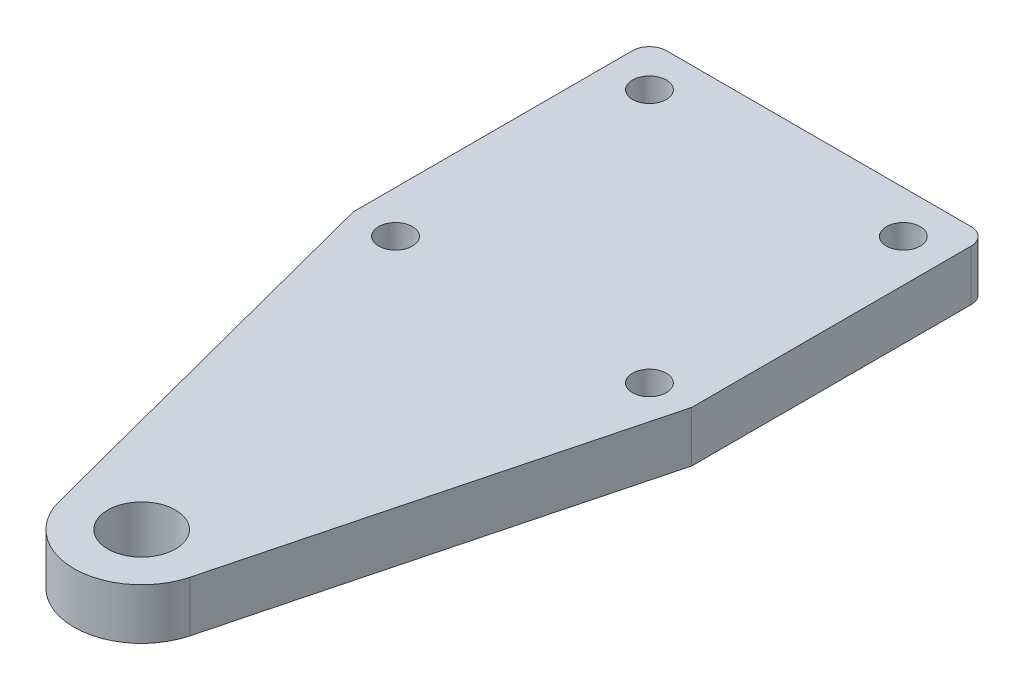
ISO-10303-21;
HEADER;
FILE_DESCRIPTION(('STEP AP214'),'2;1');
FILE_NAME('part.step','',(''),(''),'','','');
FILE_SCHEMA(('AUTOMOTIVE_DESIGN { 1 0 10303 214 1 1 1 1 }'));
ENDSEC;
DATA;
#1=APPLICATION_CONTEXT('core data for automotive mechanical design processes');
#2=APPLICATION_PROTOCOL_DEFINITION('international standard','automotive_design',2000,#1);
#3=PRODUCT_CONTEXT('',#1,'mechanical');
#4=PRODUCT('Part','Part','',(#3));
#5=PRODUCT_RELATED_PRODUCT_CATEGORY('part','',(#4));
#6=PRODUCT_DEFINITION_FORMATION('','',#4);
#7=PRODUCT_DEFINITION_CONTEXT('part definition',#1,'design');
#8=PRODUCT_DEFINITION('design','',#6,#7);
#9=PRODUCT_DEFINITION_SHAPE('','',#8);
#10=(LENGTH_UNIT() NAMED_UNIT(*) SI_UNIT(.MILLI.,.METRE.));
#11=(NAMED_UNIT(*) PLANE_ANGLE_UNIT() SI_UNIT($,.RADIAN.));
#12=(NAMED_UNIT(*) SI_UNIT($,.STERADIAN.) SOLID_ANGLE_UNIT());
#13=UNCERTAINTY_MEASURE_WITH_UNIT(LENGTH_MEASURE(1.E-05),#10,'distance_accuracy_value','');
#14=(GEOMETRIC_REPRESENTATION_CONTEXT(3) GLOBAL_UNCERTAINTY_ASSIGNED_CONTEXT((#13)) GLOBAL_UNIT_ASSIGNED_CONTEXT((#10,
#11,#12)) REPRESENTATION_CONTEXT('',''));
#15=CARTESIAN_POINT('',(0.,0.,0.));
#16=DIRECTION('',(0.,0.,1.));
#17=DIRECTION('',(1.,0.,0.));
#18=AXIS2_PLACEMENT_3D('',#15,#16,#17);
#19=CARTESIAN_POINT('',(0.,3.,30.));
#20=DIRECTION('',(0.,1.,0.));
#21=DIRECTION('',(0.,0.,1.));
#22=AXIS2_PLACEMENT_3D('',#19,#20,#21);
#23=PLANE('',#22);
#24=CARTESIAN_POINT('',(-7.5000000008142,3.,7.50000000021228));
#25=DIRECTION('',(0.,1.,0.));
#26=DIRECTION('',(0.,0.,1.));
#27=AXIS2_PLACEMENT_3D('',#24,#25,#26);
#28=CIRCLE('',#27,1.00000000084069);
#29=CARTESIAN_POINT('',(-7.5000000008142,3.,8.50000000105298));
#30=VERTEX_POINT('',#29);
#31=EDGE_CURVE('E194',#30,#30,#28,.T.);
#32=ORIENTED_EDGE('',*,*,#31,.F.);
#33=EDGE_LOOP('',(#32));
#34=FACE_BOUND('',#33,.T.);
#35=CARTESIAN_POINT('',(7.4999999991858,3.,-7.49999999978772));
#36=DIRECTION('',(0.,1.,0.));
#37=DIRECTION('',(0.,0.,1.));
#38=AXIS2_PLACEMENT_3D('',#35,#36,#37);
#39=CIRCLE('',#38,1.00000000084069);
#40=CARTESIAN_POINT('',(7.4999999991858,3.,-6.49999999894702));
#41=VERTEX_POINT('',#40);
#42=EDGE_CURVE('E182',#41,#41,#39,.T.);
#43=ORIENTED_EDGE('',*,*,#42,.F.);
#44=EDGE_LOOP('',(#43));
#45=FACE_BOUND('',#44,.T.);
#46=DIRECTION('',(0.252289669749186,0.,0.967651756851527));
#47=VECTOR('',#46,1.);
#48=CARTESIAN_POINT('',(-10.0000000008142,3.,7.50000000021228));
#49=LINE('',#48,#47);
#50=CARTESIAN_POINT('',(-10.0000000008142,3.,7.50000000021228));
#51=VERTEX_POINT('',#50);
#52=CARTESIAN_POINT('',(-3.87060702740611,3.,31.0091586789967));
#53=VERTEX_POINT('',#52);
#54=EDGE_CURVE('E145',#51,#53,#49,.T.);
#55=ORIENTED_EDGE('',*,*,#54,.T.);
#56=CARTESIAN_POINT('',(0.,3.,30.));
#57=DIRECTION('',(0.,1.,0.));
#58=DIRECTION('',(0.,0.,1.));
#59=AXIS2_PLACEMENT_3D('',#56,#57,#58);
#60=CIRCLE('',#59,4.);
#61=CARTESIAN_POINT('',(3.87060702747086,3.,31.0091586787484));
#62=VERTEX_POINT('',#61);
#63=EDGE_CURVE('E93',#53,#62,#60,.T.);
#64=ORIENTED_EDGE('',*,*,#63,.T.);
#65=DIRECTION('',(0.252289669687097,0.,-0.967651756867715));
#66=VECTOR('',#65,1.);
#67=CARTESIAN_POINT('',(9.9999999992021,3.,7.50000000021653));
#68=LINE('',#67,#66);
#69=CARTESIAN_POINT('',(9.9999999992021,3.,7.50000000021653));
#70=VERTEX_POINT('',#69);
#71=EDGE_CURVE('E160',#62,#70,#68,.T.);
#72=ORIENTED_EDGE('',*,*,#71,.T.);
#73=DIRECTION('',(0.,0.,-1.));
#74=VECTOR('',#73,1.);
#75=CARTESIAN_POINT('',(9.9999999992021,3.,-8.99999999978772));
#76=LINE('',#75,#74);
#77=CARTESIAN_POINT('',(9.9999999992021,3.,-8.99999999978772));
#78=VERTEX_POINT('',#77);
#79=EDGE_CURVE('E173',#70,#78,#76,.T.);
#80=ORIENTED_EDGE('',*,*,#79,.T.);
#81=CARTESIAN_POINT('',(8.9999999992021,3.,-8.99999999978772));
#82=DIRECTION('',(0.,1.,0.));
#83=DIRECTION('',(0.,0.,-1.));
#84=AXIS2_PLACEMENT_3D('',#81,#82,#83);
#85=CIRCLE('',#84,1.);
#86=CARTESIAN_POINT('',(8.9999999992021,3.,-9.99999999978772));
#87=VERTEX_POINT('',#86);
#88=EDGE_CURVE('E112',#78,#87,#85,.T.);
#89=ORIENTED_EDGE('',*,*,#88,.T.);
#90=DIRECTION('',(-1.,0.,0.));
#91=VECTOR('',#90,1.);
#92=CARTESIAN_POINT('',(-9.0000000008142,3.,-9.99999999978771));
#93=LINE('',#92,#91);
#94=CARTESIAN_POINT('',(-9.0000000008142,3.,-9.99999999978771));
#95=VERTEX_POINT('',#94);
#96=EDGE_CURVE('E106',#87,#95,#93,.T.);
#97=ORIENTED_EDGE('',*,*,#96,.T.);
#98=CARTESIAN_POINT('',(-9.0000000008142,3.,-8.99999999978772));
#99=DIRECTION('',(0.,1.,0.));
#100=DIRECTION('',(0.,0.,-1.));
#101=AXIS2_PLACEMENT_3D('',#98,#99,#100);
#102=CIRCLE('',#101,0.999999999999999);
#103=CARTESIAN_POINT('',(-10.0000000008142,3.,-8.99999999978772));
#104=VERTEX_POINT('',#103);
#105=EDGE_CURVE('E110',#95,#104,#102,.T.);
#106=ORIENTED_EDGE('',*,*,#105,.T.);
#107=DIRECTION('',(0.,0.,1.));
#108=VECTOR('',#107,1.);
#109=CARTESIAN_POINT('',(-10.0000000008142,3.,7.50000000021228));
#110=LINE('',#109,#108);
#111=EDGE_CURVE('E50',#104,#51,#110,.T.);
#112=ORIENTED_EDGE('',*,*,#111,.T.);
#113=EDGE_LOOP('',(#55,#64,#72,#80,#89,#97,#106,#112));
#114=FACE_BOUND('',#113,.T.);
#115=CARTESIAN_POINT('',(-7.5000000008142,3.,-7.49999999978772));
#116=DIRECTION('',(0.,1.,0.));
#117=DIRECTION('',(0.,0.,1.));
#118=AXIS2_PLACEMENT_3D('',#115,#116,#117);
#119=CIRCLE('',#118,1.00000000084069);
#120=CARTESIAN_POINT('',(-7.5000000008142,3.,-6.49999999894702));
#121=VERTEX_POINT('',#120);
#122=EDGE_CURVE('E134',#121,#121,#119,.T.);
#123=ORIENTED_EDGE('',*,*,#122,.F.);
#124=EDGE_LOOP('',(#123));
#125=FACE_BOUND('',#124,.T.);
#126=CARTESIAN_POINT('',(7.4999999991858,3.,7.50000000021228));
#127=DIRECTION('',(0.,1.,0.));
#128=DIRECTION('',(0.,0.,1.));
#129=AXIS2_PLACEMENT_3D('',#126,#127,#128);
#130=CIRCLE('',#129,1.00000000084069);
#131=CARTESIAN_POINT('',(7.4999999991858,3.,8.50000000105298));
#132=VERTEX_POINT('',#131);
#133=EDGE_CURVE('E188',#132,#132,#130,.T.);
#134=ORIENTED_EDGE('',*,*,#133,.F.);
#135=EDGE_LOOP('',(#134));
#136=FACE_BOUND('',#135,.T.);
#137=CARTESIAN_POINT('',(0.,3.,30.));
#138=DIRECTION('',(0.,1.,0.));
#139=DIRECTION('',(0.,0.,1.));
#140=AXIS2_PLACEMENT_3D('',#137,#138,#139);
#141=CIRCLE('',#140,2.);
#142=CARTESIAN_POINT('',(0.,3.,32.));
#143=VERTEX_POINT('',#142);
#144=EDGE_CURVE('E200',#143,#143,#141,.T.);
#145=ORIENTED_EDGE('',*,*,#144,.F.);
#146=EDGE_LOOP('',(#145));
#147=FACE_BOUND('',#146,.T.);
#148=ADVANCED_FACE('F33',(#34,#45,#114,#125,#136,#147),#23,.T.);
#149=CARTESIAN_POINT('',(0.,0.,30.));
#150=DIRECTION('',(0.,1.,0.));
#151=DIRECTION('',(0.,0.,1.));
#152=AXIS2_PLACEMENT_3D('',#149,#150,#151);
#153=PLANE('',#152);
#154=CARTESIAN_POINT('',(-7.5000000008142,0.,7.50000000021228));
#155=DIRECTION('',(0.,1.,0.));
#156=DIRECTION('',(0.,0.,1.));
#157=AXIS2_PLACEMENT_3D('',#154,#155,#156);
#158=CIRCLE('',#157,1.00000000084069);
#159=CARTESIAN_POINT('',(-7.5000000008142,0.,8.50000000105298));
#160=VERTEX_POINT('',#159);
#161=EDGE_CURVE('E197',#160,#160,#158,.T.);
#162=ORIENTED_EDGE('',*,*,#161,.T.);
#163=EDGE_LOOP('',(#162));
#164=FACE_BOUND('',#163,.T.);
#165=CARTESIAN_POINT('',(7.4999999991858,0.,-7.49999999978772));
#166=DIRECTION('',(0.,1.,0.));
#167=DIRECTION('',(0.,0.,1.));
#168=AXIS2_PLACEMENT_3D('',#165,#166,#167);
#169=CIRCLE('',#168,1.00000000084069);
#170=CARTESIAN_POINT('',(7.4999999991858,0.,-6.49999999894702));
#171=VERTEX_POINT('',#170);
#172=EDGE_CURVE('E185',#171,#171,#169,.T.);
#173=ORIENTED_EDGE('',*,*,#172,.T.);
#174=EDGE_LOOP('',(#173));
#175=FACE_BOUND('',#174,.T.);
#176=DIRECTION('',(0.252289669749186,0.,0.967651756851527));
#177=VECTOR('',#176,1.);
#178=CARTESIAN_POINT('',(-10.0000000008142,0.,7.50000000021228));
#179=LINE('',#178,#177);
#180=CARTESIAN_POINT('',(-10.0000000008142,0.,7.50000000021228));
#181=VERTEX_POINT('',#180);
#182=CARTESIAN_POINT('',(-3.87060702740611,0.,31.0091586789967));
#183=VERTEX_POINT('',#182);
#184=EDGE_CURVE('E130',#181,#183,#179,.T.);
#185=ORIENTED_EDGE('',*,*,#184,.F.);
#186=DIRECTION('',(0.,0.,1.));
#187=VECTOR('',#186,1.);
#188=CARTESIAN_POINT('',(-10.0000000008142,0.,7.50000000021228));
#189=LINE('',#188,#187);
#190=CARTESIAN_POINT('',(-10.0000000008142,0.,-8.99999999978772));
#191=VERTEX_POINT('',#190);
#192=EDGE_CURVE('E85',#191,#181,#189,.T.);
#193=ORIENTED_EDGE('',*,*,#192,.F.);
#194=CARTESIAN_POINT('',(-9.0000000008142,0.,-8.99999999978772));
#195=DIRECTION('',(0.,1.,0.));
#196=DIRECTION('',(0.,0.,-1.));
#197=AXIS2_PLACEMENT_3D('',#194,#195,#196);
#198=CIRCLE('',#197,0.999999999999999);
#199=CARTESIAN_POINT('',(-9.0000000008142,0.,-9.99999999978771));
#200=VERTEX_POINT('',#199);
#201=EDGE_CURVE('E79',#200,#191,#198,.T.);
#202=ORIENTED_EDGE('',*,*,#201,.F.);
#203=DIRECTION('',(-1.,0.,0.));
#204=VECTOR('',#203,1.);
#205=CARTESIAN_POINT('',(-9.0000000008142,0.,-9.99999999978771));
#206=LINE('',#205,#204);
#207=CARTESIAN_POINT('',(8.9999999992021,0.,-9.99999999978772));
#208=VERTEX_POINT('',#207);
#209=EDGE_CURVE('E120',#208,#200,#206,.T.);
#210=ORIENTED_EDGE('',*,*,#209,.F.);
#211=CARTESIAN_POINT('',(8.9999999992021,0.,-8.99999999978772));
#212=DIRECTION('',(0.,1.,0.));
#213=DIRECTION('',(0.,0.,-1.));
#214=AXIS2_PLACEMENT_3D('',#211,#212,#213);
#215=CIRCLE('',#214,1.);
#216=CARTESIAN_POINT('',(9.9999999992021,0.,-8.99999999978772));
#217=VERTEX_POINT('',#216);
#218=EDGE_CURVE('E140',#217,#208,#215,.T.);
#219=ORIENTED_EDGE('',*,*,#218,.F.);
#220=DIRECTION('',(0.,0.,-1.));
#221=VECTOR('',#220,1.);
#222=CARTESIAN_POINT('',(9.9999999992021,0.,-8.99999999978772));
#223=LINE('',#222,#221);
#224=CARTESIAN_POINT('',(9.9999999992021,0.,7.50000000021653));
#225=VERTEX_POINT('',#224);
#226=EDGE_CURVE('E138',#225,#217,#223,.T.);
#227=ORIENTED_EDGE('',*,*,#226,.F.);
#228=DIRECTION('',(0.252289669687097,0.,-0.967651756867715));
#229=VECTOR('',#228,1.);
#230=CARTESIAN_POINT('',(9.9999999992021,0.,7.50000000021653));
#231=LINE('',#230,#229);
#232=CARTESIAN_POINT('',(3.87060702747086,0.,31.0091586787484));
#233=VERTEX_POINT('',#232);
#234=EDGE_CURVE('E136',#233,#225,#231,.T.);
#235=ORIENTED_EDGE('',*,*,#234,.F.);
#236=CARTESIAN_POINT('',(0.,0.,30.));
#237=DIRECTION('',(0.,1.,0.));
#238=DIRECTION('',(0.,0.,1.));
#239=AXIS2_PLACEMENT_3D('',#236,#237,#238);
#240=CIRCLE('',#239,4.);
#241=EDGE_CURVE('E133',#183,#233,#240,.T.);
#242=ORIENTED_EDGE('',*,*,#241,.F.);
#243=EDGE_LOOP('',(#185,#193,#202,#210,#219,#227,#235,#242));
#244=FACE_BOUND('',#243,.T.);
#245=CARTESIAN_POINT('',(-7.5000000008142,0.,-7.49999999978772));
#246=DIRECTION('',(0.,1.,0.));
#247=DIRECTION('',(0.,0.,1.));
#248=AXIS2_PLACEMENT_3D('',#245,#246,#247);
#249=CIRCLE('',#248,1.00000000084069);
#250=CARTESIAN_POINT('',(-7.5000000008142,0.,-6.49999999894702));
#251=VERTEX_POINT('',#250);
#252=EDGE_CURVE('E179',#251,#251,#249,.T.);
#253=ORIENTED_EDGE('',*,*,#252,.T.);
#254=EDGE_LOOP('',(#253));
#255=FACE_BOUND('',#254,.T.);
#256=CARTESIAN_POINT('',(7.4999999991858,0.,7.50000000021228));
#257=DIRECTION('',(0.,1.,0.));
#258=DIRECTION('',(0.,0.,1.));
#259=AXIS2_PLACEMENT_3D('',#256,#257,#258);
#260=CIRCLE('',#259,1.00000000084069);
#261=CARTESIAN_POINT('',(7.4999999991858,0.,8.50000000105298));
#262=VERTEX_POINT('',#261);
#263=EDGE_CURVE('E191',#262,#262,#260,.T.);
#264=ORIENTED_EDGE('',*,*,#263,.T.);
#265=EDGE_LOOP('',(#264));
#266=FACE_BOUND('',#265,.T.);
#267=CARTESIAN_POINT('',(0.,0.,30.));
#268=DIRECTION('',(0.,1.,0.));
#269=DIRECTION('',(0.,0.,1.));
#270=AXIS2_PLACEMENT_3D('',#267,#268,#269);
#271=CIRCLE('',#270,2.);
#272=CARTESIAN_POINT('',(0.,0.,32.));
#273=VERTEX_POINT('',#272);
#274=EDGE_CURVE('E203',#273,#273,#271,.T.);
#275=ORIENTED_EDGE('',*,*,#274,.T.);
#276=EDGE_LOOP('',(#275));
#277=FACE_BOUND('',#276,.T.);
#278=ADVANCED_FACE('F164',(#164,#175,#244,#255,#266,#277),#153,.F.);
#279=CARTESIAN_POINT('',(-10.0000000008142,3.,7.50000000021228));
#280=DIRECTION('',(0.967651756851527,0.,-0.252289669749186));
#281=DIRECTION('',(-0.252289669749186,0.,-0.967651756851527));
#282=AXIS2_PLACEMENT_3D('',#279,#280,#281);
#283=PLANE('',#282);
#284=ORIENTED_EDGE('',*,*,#184,.T.);
#285=DIRECTION('',(0.,-1.,0.));
#286=VECTOR('',#285,1.);
#287=CARTESIAN_POINT('',(-3.87060702740611,3.,31.0091586789967));
#288=LINE('',#287,#286);
#289=EDGE_CURVE('E11',#53,#183,#288,.T.);
#290=ORIENTED_EDGE('',*,*,#289,.F.);
#291=ORIENTED_EDGE('',*,*,#54,.F.);
#292=DIRECTION('',(0.,-1.,0.));
#293=VECTOR('',#292,1.);
#294=CARTESIAN_POINT('',(-10.0000000008142,3.,7.50000000021228));
#295=LINE('',#294,#293);
#296=EDGE_CURVE('E126',#51,#181,#295,.T.);
#297=ORIENTED_EDGE('',*,*,#296,.T.);
#298=EDGE_LOOP('',(#284,#290,#291,#297));
#299=FACE_BOUND('',#298,.T.);
#300=ADVANCED_FACE('F35',(#299),#283,.F.);
#301=CARTESIAN_POINT('',(0.,3.,30.));
#302=DIRECTION('',(0.,-1.,0.));
#303=DIRECTION('',(0.,0.,-1.));
#304=AXIS2_PLACEMENT_3D('',#301,#302,#303);
#305=CYLINDRICAL_SURFACE('',#304,4.);
#306=ORIENTED_EDGE('',*,*,#241,.T.);
#307=DIRECTION('',(0.,-1.,0.));
#308=VECTOR('',#307,1.);
#309=CARTESIAN_POINT('',(3.87060702747086,3.,31.0091586787484));
#310=LINE('',#309,#308);
#311=EDGE_CURVE('E42',#62,#233,#310,.T.);
#312=ORIENTED_EDGE('',*,*,#311,.F.);
#313=ORIENTED_EDGE('',*,*,#63,.F.);
#314=ORIENTED_EDGE('',*,*,#289,.T.);
#315=EDGE_LOOP('',(#306,#312,#313,#314));
#316=FACE_BOUND('',#315,.T.);
#317=ADVANCED_FACE('F238',(#316),#305,.T.);
#318=CARTESIAN_POINT('',(9.9999999992021,3.,7.50000000021653));
#319=DIRECTION('',(-0.967651756867715,0.,-0.252289669687097));
#320=DIRECTION('',(-0.252289669687097,0.,0.967651756867715));
#321=AXIS2_PLACEMENT_3D('',#318,#319,#320);
#322=PLANE('',#321);
#323=ORIENTED_EDGE('',*,*,#234,.T.);
#324=DIRECTION('',(0.,-1.,0.));
#325=VECTOR('',#324,1.);
#326=CARTESIAN_POINT('',(9.9999999992021,3.,7.50000000021653));
#327=LINE('',#326,#325);
#328=EDGE_CURVE('E152',#70,#225,#327,.T.);
#329=ORIENTED_EDGE('',*,*,#328,.F.);
#330=ORIENTED_EDGE('',*,*,#71,.F.);
#331=ORIENTED_EDGE('',*,*,#311,.T.);
#332=EDGE_LOOP('',(#323,#329,#330,#331));
#333=FACE_BOUND('',#332,.T.);
#334=ADVANCED_FACE('F158',(#333),#322,.F.);
#335=CARTESIAN_POINT('',(9.9999999992021,3.,-8.99999999978772));
#336=DIRECTION('',(-1.,0.,0.));
#337=DIRECTION('',(0.,0.,1.));
#338=AXIS2_PLACEMENT_3D('',#335,#336,#337);
#339=PLANE('',#338);
#340=ORIENTED_EDGE('',*,*,#226,.T.);
#341=DIRECTION('',(0.,-1.,0.));
#342=VECTOR('',#341,1.);
#343=CARTESIAN_POINT('',(9.9999999992021,3.,-8.99999999978772));
#344=LINE('',#343,#342);
#345=EDGE_CURVE('E149',#78,#217,#344,.T.);
#346=ORIENTED_EDGE('',*,*,#345,.F.);
#347=ORIENTED_EDGE('',*,*,#79,.F.);
#348=ORIENTED_EDGE('',*,*,#328,.T.);
#349=EDGE_LOOP('',(#340,#346,#347,#348));
#350=FACE_BOUND('',#349,.T.);
#351=ADVANCED_FACE('F169',(#350),#339,.F.);
#352=CARTESIAN_POINT('',(8.9999999992021,3.,-8.99999999978772));
#353=DIRECTION('',(0.,-1.,0.));
#354=DIRECTION('',(0.,0.,-1.));
#355=AXIS2_PLACEMENT_3D('',#352,#353,#354);
#356=CYLINDRICAL_SURFACE('',#355,1.);
#357=ORIENTED_EDGE('',*,*,#218,.T.);
#358=DIRECTION('',(0.,-1.,0.));
#359=VECTOR('',#358,1.);
#360=CARTESIAN_POINT('',(8.9999999992021,3.,-9.99999999978772));
#361=LINE('',#360,#359);
#362=EDGE_CURVE('E121',#87,#208,#361,.T.);
#363=ORIENTED_EDGE('',*,*,#362,.F.);
#364=ORIENTED_EDGE('',*,*,#88,.F.);
#365=ORIENTED_EDGE('',*,*,#345,.T.);
#366=EDGE_LOOP('',(#357,#363,#364,#365));
#367=FACE_BOUND('',#366,.T.);
#368=ADVANCED_FACE('F172',(#367),#356,.T.);
#369=CARTESIAN_POINT('',(-9.0000000008142,3.,-9.99999999978771));
#370=DIRECTION('',(0.,0.,1.));
#371=DIRECTION('',(1.,0.,0.));
#372=AXIS2_PLACEMENT_3D('',#369,#370,#371);
#373=PLANE('',#372);
#374=ORIENTED_EDGE('',*,*,#209,.T.);
#375=DIRECTION('',(0.,-1.,0.));
#376=VECTOR('',#375,1.);
#377=CARTESIAN_POINT('',(-9.0000000008142,3.,-9.99999999978771));
#378=LINE('',#377,#376);
#379=EDGE_CURVE('E117',#95,#200,#378,.T.);
#380=ORIENTED_EDGE('',*,*,#379,.F.);
#381=ORIENTED_EDGE('',*,*,#96,.F.);
#382=ORIENTED_EDGE('',*,*,#362,.T.);
#383=EDGE_LOOP('',(#374,#380,#381,#382));
#384=FACE_BOUND('',#383,.T.);
#385=ADVANCED_FACE('F118',(#384),#373,.F.);
#386=CARTESIAN_POINT('',(-9.0000000008142,3.,-8.99999999978772));
#387=DIRECTION('',(0.,-1.,0.));
#388=DIRECTION('',(0.,0.,-1.));
#389=AXIS2_PLACEMENT_3D('',#386,#387,#388);
#390=CYLINDRICAL_SURFACE('',#389,0.999999999999999);
#391=ORIENTED_EDGE('',*,*,#201,.T.);
#392=DIRECTION('',(0.,-1.,0.));
#393=VECTOR('',#392,1.);
#394=CARTESIAN_POINT('',(-10.0000000008142,3.,-8.99999999978772));
#395=LINE('',#394,#393);
#396=EDGE_CURVE('E122',#104,#191,#395,.T.);
#397=ORIENTED_EDGE('',*,*,#396,.F.);
#398=ORIENTED_EDGE('',*,*,#105,.F.);
#399=ORIENTED_EDGE('',*,*,#379,.T.);
#400=EDGE_LOOP('',(#391,#397,#398,#399));
#401=FACE_BOUND('',#400,.T.);
#402=ADVANCED_FACE('F124',(#401),#390,.T.);
#403=CARTESIAN_POINT('',(-10.0000000008142,3.,7.50000000021228));
#404=DIRECTION('',(1.,0.,0.));
#405=DIRECTION('',(0.,0.,-1.));
#406=AXIS2_PLACEMENT_3D('',#403,#404,#405);
#407=PLANE('',#406);
#408=ORIENTED_EDGE('',*,*,#192,.T.);
#409=ORIENTED_EDGE('',*,*,#296,.F.);
#410=ORIENTED_EDGE('',*,*,#111,.F.);
#411=ORIENTED_EDGE('',*,*,#396,.T.);
#412=EDGE_LOOP('',(#408,#409,#410,#411));
#413=FACE_BOUND('',#412,.T.);
#414=ADVANCED_FACE('F226',(#413),#407,.F.);
#415=CARTESIAN_POINT('',(-7.5000000008142,3.,-7.49999999978772));
#416=DIRECTION('',(0.,-1.,0.));
#417=DIRECTION('',(0.,0.,-1.));
#418=AXIS2_PLACEMENT_3D('',#415,#416,#417);
#419=CYLINDRICAL_SURFACE('',#418,1.00000000084069);
#420=ORIENTED_EDGE('',*,*,#122,.T.);
#421=EDGE_LOOP('',(#420));
#422=FACE_BOUND('',#421,.T.);
#423=ORIENTED_EDGE('',*,*,#252,.F.);
#424=EDGE_LOOP('',(#423));
#425=FACE_BOUND('',#424,.T.);
#426=ADVANCED_FACE('F223',(#422,#425),#419,.F.);
#427=CARTESIAN_POINT('',(7.4999999991858,3.,-7.49999999978772));
#428=DIRECTION('',(0.,-1.,0.));
#429=DIRECTION('',(0.,0.,-1.));
#430=AXIS2_PLACEMENT_3D('',#427,#428,#429);
#431=CYLINDRICAL_SURFACE('',#430,1.00000000084069);
#432=ORIENTED_EDGE('',*,*,#42,.T.);
#433=EDGE_LOOP('',(#432));
#434=FACE_BOUND('',#433,.T.);
#435=ORIENTED_EDGE('',*,*,#172,.F.);
#436=EDGE_LOOP('',(#435));
#437=FACE_BOUND('',#436,.T.);
#438=ADVANCED_FACE('F302',(#434,#437),#431,.F.);
#439=CARTESIAN_POINT('',(7.4999999991858,3.,7.50000000021228));
#440=DIRECTION('',(0.,-1.,0.));
#441=DIRECTION('',(0.,0.,-1.));
#442=AXIS2_PLACEMENT_3D('',#439,#440,#441);
#443=CYLINDRICAL_SURFACE('',#442,1.00000000084069);
#444=ORIENTED_EDGE('',*,*,#133,.T.);
#445=EDGE_LOOP('',(#444));
#446=FACE_BOUND('',#445,.T.);
#447=ORIENTED_EDGE('',*,*,#263,.F.);
#448=EDGE_LOOP('',(#447));
#449=FACE_BOUND('',#448,.T.);
#450=ADVANCED_FACE('F310',(#446,#449),#443,.F.);
#451=CARTESIAN_POINT('',(-7.5000000008142,3.,7.50000000021228));
#452=DIRECTION('',(0.,-1.,0.));
#453=DIRECTION('',(0.,0.,-1.));
#454=AXIS2_PLACEMENT_3D('',#451,#452,#453);
#455=CYLINDRICAL_SURFACE('',#454,1.00000000084069);
#456=ORIENTED_EDGE('',*,*,#31,.T.);
#457=EDGE_LOOP('',(#456));
#458=FACE_BOUND('',#457,.T.);
#459=ORIENTED_EDGE('',*,*,#161,.F.);
#460=EDGE_LOOP('',(#459));
#461=FACE_BOUND('',#460,.T.);
#462=ADVANCED_FACE('F318',(#458,#461),#455,.F.);
#463=CARTESIAN_POINT('',(0.,3.,30.));
#464=DIRECTION('',(0.,-1.,0.));
#465=DIRECTION('',(0.,0.,-1.));
#466=AXIS2_PLACEMENT_3D('',#463,#464,#465);
#467=CYLINDRICAL_SURFACE('',#466,2.);
#468=ORIENTED_EDGE('',*,*,#144,.T.);
#469=EDGE_LOOP('',(#468));
#470=FACE_BOUND('',#469,.T.);
#471=ORIENTED_EDGE('',*,*,#274,.F.);
#472=EDGE_LOOP('',(#471));
#473=FACE_BOUND('',#472,.T.);
#474=ADVANCED_FACE('F209',(#470,#473),#467,.F.);
#475=CLOSED_SHELL('',(#148,#278,#300,#317,#334,#351,#368,#385,#402,#414,#426,#438,#450,#462,#474));
#476=MANIFOLD_SOLID_BREP('B2',#475);
#477=ADVANCED_BREP_SHAPE_REPRESENTATION('',(#18,#476),#14);
#478=SHAPE_DEFINITION_REPRESENTATION(#9,#477);
ENDSEC;
END-ISO-10303-21;
